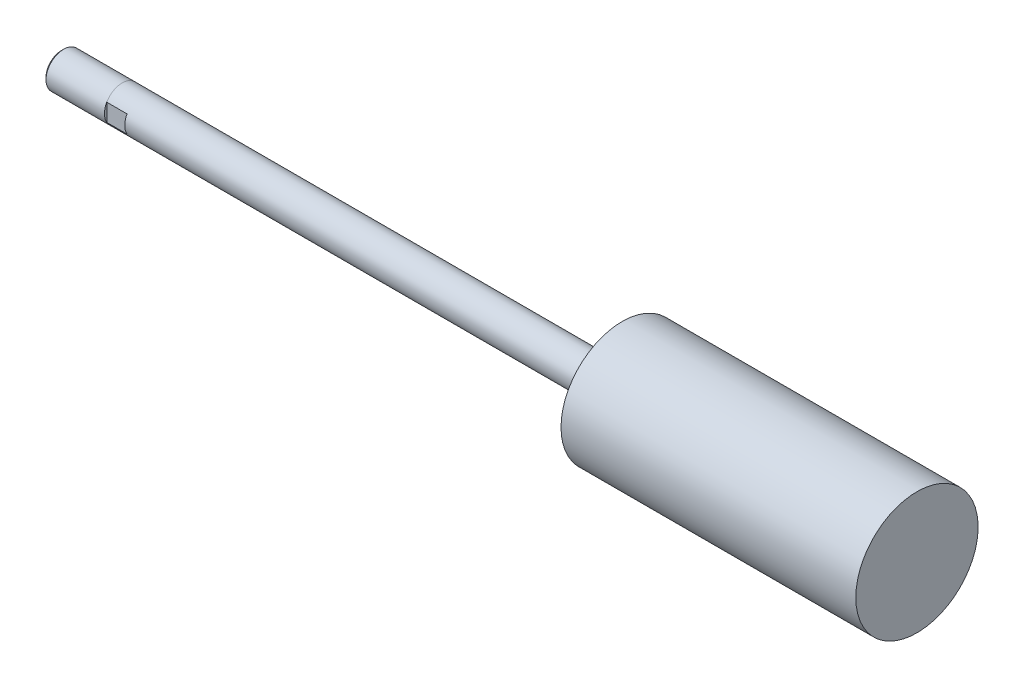
ISO-10303-21;
HEADER;
FILE_DESCRIPTION(('STEP AP214'),'2;1');
FILE_NAME('part.step','',(''),(''),'','','');
FILE_SCHEMA(('AUTOMOTIVE_DESIGN { 1 0 10303 214 1 1 1 1 }'));
ENDSEC;
DATA;
#1=APPLICATION_CONTEXT('core data for automotive mechanical design processes');
#2=APPLICATION_PROTOCOL_DEFINITION('international standard','automotive_design',2000,#1);
#3=PRODUCT_CONTEXT('',#1,'mechanical');
#4=PRODUCT('Part','Part','',(#3));
#5=PRODUCT_RELATED_PRODUCT_CATEGORY('part','',(#4));
#6=PRODUCT_DEFINITION_FORMATION('','',#4);
#7=PRODUCT_DEFINITION_CONTEXT('part definition',#1,'design');
#8=PRODUCT_DEFINITION('design','',#6,#7);
#9=PRODUCT_DEFINITION_SHAPE('','',#8);
#10=(LENGTH_UNIT() NAMED_UNIT(*) SI_UNIT(.MILLI.,.METRE.));
#11=(NAMED_UNIT(*) PLANE_ANGLE_UNIT() SI_UNIT($,.RADIAN.));
#12=(NAMED_UNIT(*) SI_UNIT($,.STERADIAN.) SOLID_ANGLE_UNIT());
#13=UNCERTAINTY_MEASURE_WITH_UNIT(LENGTH_MEASURE(1.E-05),#10,'distance_accuracy_value','');
#14=(GEOMETRIC_REPRESENTATION_CONTEXT(3) GLOBAL_UNCERTAINTY_ASSIGNED_CONTEXT((#13)) GLOBAL_UNIT_ASSIGNED_CONTEXT((#10,
#11,#12)) REPRESENTATION_CONTEXT('',''));
#15=CARTESIAN_POINT('',(0.,0.,0.));
#16=DIRECTION('',(0.,0.,1.));
#17=DIRECTION('',(1.,0.,0.));
#18=AXIS2_PLACEMENT_3D('',#15,#16,#17);
#19=CARTESIAN_POINT('',(242.443,0.,0.));
#20=DIRECTION('',(-1.,0.,0.));
#21=DIRECTION('',(0.,0.,1.));
#22=AXIS2_PLACEMENT_3D('',#19,#20,#21);
#23=CYLINDRICAL_SURFACE('',#22,5.5499);
#24=DIRECTION('',(-1.,0.,0.));
#25=VECTOR('',#24,1.);
#26=CARTESIAN_POINT('',(242.443,2.74064116768321,-4.826));
#27=LINE('',#26,#25);
#28=CARTESIAN_POINT('',(0.,2.74064116768321,-4.826));
#29=VERTEX_POINT('',#28);
#30=CARTESIAN_POINT('',(-6.35,2.74705930837324,-4.826));
#31=VERTEX_POINT('',#30);
#32=EDGE_CURVE('E100',#29,#31,#27,.T.);
#33=ORIENTED_EDGE('',*,*,#32,.T.);
#34=CARTESIAN_POINT('',(-6.35,0.,0.));
#35=DIRECTION('',(-1.,0.,0.));
#36=DIRECTION('',(0.,0.49469130573276,0.869068761394872));
#37=AXIS2_PLACEMENT_3D('',#34,#35,#36);
#38=CIRCLE('',#37,5.55625);
#39=CARTESIAN_POINT('',(-6.35,2.74705792258195,4.82600401218283));
#40=VERTEX_POINT('',#39);
#41=EDGE_CURVE('E80',#40,#31,#38,.T.);
#42=ORIENTED_EDGE('',*,*,#41,.F.);
#43=DIRECTION('',(-1.,0.,0.));
#44=VECTOR('',#43,1.);
#45=CARTESIAN_POINT('',(242.443,2.74064116768321,4.826));
#46=LINE('',#45,#44);
#47=CARTESIAN_POINT('',(0.,2.74064116768321,4.826));
#48=VERTEX_POINT('',#47);
#49=EDGE_CURVE('E109',#40,#48,#46,.F.);
#50=ORIENTED_EDGE('',*,*,#49,.T.);
#51=CARTESIAN_POINT('',(0.,0.,0.));
#52=DIRECTION('',(1.,0.,0.));
#53=DIRECTION('',(0.,0.,-1.));
#54=AXIS2_PLACEMENT_3D('',#51,#52,#53);
#55=CIRCLE('',#54,5.5499);
#56=CARTESIAN_POINT('',(0.,-2.74064116768321,4.826));
#57=VERTEX_POINT('',#56);
#58=EDGE_CURVE('E11',#48,#57,#55,.T.);
#59=ORIENTED_EDGE('',*,*,#58,.T.);
#60=DIRECTION('',(-1.,0.,0.));
#61=VECTOR('',#60,1.);
#62=CARTESIAN_POINT('',(242.443,-2.74064116768321,4.826));
#63=LINE('',#62,#61);
#64=CARTESIAN_POINT('',(-6.35,-2.74705930837324,4.826));
#65=VERTEX_POINT('',#64);
#66=EDGE_CURVE('E111',#57,#65,#63,.T.);
#67=ORIENTED_EDGE('',*,*,#66,.T.);
#68=CARTESIAN_POINT('',(-6.35,0.,0.));
#69=DIRECTION('',(-1.,0.,0.));
#70=DIRECTION('',(0.,-0.494691305732761,-0.869068761394871));
#71=AXIS2_PLACEMENT_3D('',#68,#69,#70);
#72=CIRCLE('',#71,5.55625);
#73=CARTESIAN_POINT('',(-6.35000000000001,-2.74705792258195,-4.82600401218282));
#74=VERTEX_POINT('',#73);
#75=EDGE_CURVE('E94',#74,#65,#72,.T.);
#76=ORIENTED_EDGE('',*,*,#75,.F.);
#77=DIRECTION('',(-1.,0.,0.));
#78=VECTOR('',#77,1.);
#79=CARTESIAN_POINT('',(242.443,-2.74064116768321,-4.826));
#80=LINE('',#79,#78);
#81=CARTESIAN_POINT('',(0.,-2.74064116768321,-4.826));
#82=VERTEX_POINT('',#81);
#83=EDGE_CURVE('E103',#74,#82,#80,.F.);
#84=ORIENTED_EDGE('',*,*,#83,.T.);
#85=EDGE_CURVE('E40',#82,#29,#55,.T.);
#86=ORIENTED_EDGE('',*,*,#85,.T.);
#87=EDGE_LOOP('',(#33,#42,#50,#59,#67,#76,#84,#86));
#88=FACE_BOUND('',#87,.T.);
#89=CARTESIAN_POINT('',(150.1648,0.,0.));
#90=DIRECTION('',(-1.,0.,0.));
#91=DIRECTION('',(0.,0.,1.));
#92=AXIS2_PLACEMENT_3D('',#89,#90,#91);
#93=CIRCLE('',#92,5.5499);
#94=CARTESIAN_POINT('',(150.1648,0.,5.5499));
#95=VERTEX_POINT('',#94);
#96=EDGE_CURVE('E199',#95,#95,#93,.T.);
#97=ORIENTED_EDGE('',*,*,#96,.T.);
#98=EDGE_LOOP('',(#97));
#99=FACE_BOUND('',#98,.T.);
#100=ADVANCED_FACE('F36',(#88,#99),#23,.T.);
#101=CARTESIAN_POINT('',(150.1648,5.5499,0.));
#102=DIRECTION('',(1.,0.,0.));
#103=DIRECTION('',(0.,0.,-1.));
#104=AXIS2_PLACEMENT_3D('',#101,#102,#103);
#105=PLANE('',#104);
#106=ORIENTED_EDGE('',*,*,#96,.F.);
#107=EDGE_LOOP('',(#106));
#108=FACE_BOUND('',#107,.T.);
#109=CARTESIAN_POINT('',(150.1648,0.,0.));
#110=DIRECTION('',(-1.,0.,0.));
#111=DIRECTION('',(0.,0.,1.));
#112=AXIS2_PLACEMENT_3D('',#109,#110,#111);
#113=CIRCLE('',#112,19.14525);
#114=CARTESIAN_POINT('',(150.1648,0.,19.14525));
#115=VERTEX_POINT('',#114);
#116=EDGE_CURVE('E201',#115,#115,#113,.T.);
#117=ORIENTED_EDGE('',*,*,#116,.T.);
#118=EDGE_LOOP('',(#117));
#119=FACE_BOUND('',#118,.T.);
#120=ADVANCED_FACE('F219',(#108,#119),#105,.F.);
#121=CARTESIAN_POINT('',(242.443,0.,0.));
#122=DIRECTION('',(-1.,0.,0.));
#123=DIRECTION('',(0.,0.,1.));
#124=AXIS2_PLACEMENT_3D('',#121,#122,#123);
#125=CYLINDRICAL_SURFACE('',#124,19.14525);
#126=ORIENTED_EDGE('',*,*,#116,.F.);
#127=EDGE_LOOP('',(#126));
#128=FACE_BOUND('',#127,.T.);
#129=CARTESIAN_POINT('',(242.443,0.,0.));
#130=DIRECTION('',(-1.,0.,0.));
#131=DIRECTION('',(0.,0.,1.));
#132=AXIS2_PLACEMENT_3D('',#129,#130,#131);
#133=CIRCLE('',#132,19.14525);
#134=CARTESIAN_POINT('',(242.443,0.,19.14525));
#135=VERTEX_POINT('',#134);
#136=EDGE_CURVE('E144',#135,#135,#133,.T.);
#137=ORIENTED_EDGE('',*,*,#136,.T.);
#138=EDGE_LOOP('',(#137));
#139=FACE_BOUND('',#138,.T.);
#140=ADVANCED_FACE('F208',(#128,#139),#125,.T.);
#141=CARTESIAN_POINT('',(242.443,19.14525,0.));
#142=DIRECTION('',(-1.,0.,0.));
#143=DIRECTION('',(0.,0.,1.));
#144=AXIS2_PLACEMENT_3D('',#141,#142,#143);
#145=PLANE('',#144);
#146=ORIENTED_EDGE('',*,*,#136,.F.);
#147=EDGE_LOOP('',(#146));
#148=FACE_BOUND('',#147,.T.);
#149=ADVANCED_FACE('F210',(#148),#145,.F.);
#150=CARTESIAN_POINT('',(-25.4,0.,0.));
#151=DIRECTION('',(1.,0.,0.));
#152=DIRECTION('',(0.,0.,-1.));
#153=AXIS2_PLACEMENT_3D('',#150,#151,#152);
#154=PLANE('',#153);
#155=CARTESIAN_POINT('',(-25.4,0.,0.));
#156=DIRECTION('',(-1.,0.,0.));
#157=DIRECTION('',(0.,0.,1.));
#158=AXIS2_PLACEMENT_3D('',#155,#156,#157);
#159=CIRCLE('',#158,4.8006);
#160=CARTESIAN_POINT('',(-25.4,0.,4.8006));
#161=VERTEX_POINT('',#160);
#162=EDGE_CURVE('E137',#161,#161,#159,.T.);
#163=ORIENTED_EDGE('',*,*,#162,.T.);
#164=EDGE_LOOP('',(#163));
#165=FACE_BOUND('',#164,.T.);
#166=ADVANCED_FACE('F212',(#165),#154,.F.);
#167=CARTESIAN_POINT('',(-24.64435,0.,0.));
#168=DIRECTION('',(1.,0.,0.));
#169=DIRECTION('',(0.,0.,-1.));
#170=AXIS2_PLACEMENT_3D('',#167,#168,#169);
#171=CONICAL_SURFACE('',#170,5.55625,0.785398163397451);
#172=ORIENTED_EDGE('',*,*,#162,.F.);
#173=EDGE_LOOP('',(#172));
#174=FACE_BOUND('',#173,.T.);
#175=CARTESIAN_POINT('',(-24.64435,0.,0.));
#176=DIRECTION('',(-1.,0.,0.));
#177=DIRECTION('',(0.,0.,1.));
#178=AXIS2_PLACEMENT_3D('',#175,#176,#177);
#179=CIRCLE('',#178,5.55625);
#180=CARTESIAN_POINT('',(-24.64435,0.,5.55625));
#181=VERTEX_POINT('',#180);
#182=EDGE_CURVE('E134',#181,#181,#179,.T.);
#183=ORIENTED_EDGE('',*,*,#182,.T.);
#184=EDGE_LOOP('',(#183));
#185=FACE_BOUND('',#184,.T.);
#186=ADVANCED_FACE('F172',(#174,#185),#171,.T.);
#187=CARTESIAN_POINT('',(-6.35,0.,0.));
#188=DIRECTION('',(-1.,0.,0.));
#189=DIRECTION('',(0.,0.,1.));
#190=AXIS2_PLACEMENT_3D('',#187,#188,#189);
#191=CYLINDRICAL_SURFACE('',#190,5.55625);
#192=ORIENTED_EDGE('',*,*,#182,.F.);
#193=EDGE_LOOP('',(#192));
#194=FACE_BOUND('',#193,.T.);
#195=ORIENTED_EDGE('',*,*,#41,.T.);
#196=CARTESIAN_POINT('',(-6.35,0.,0.));
#197=DIRECTION('',(-1.,0.,0.));
#198=DIRECTION('',(0.,0.494691305732778,-0.869068761394862));
#199=AXIS2_PLACEMENT_3D('',#196,#197,#198);
#200=CIRCLE('',#199,5.55625);
#201=EDGE_CURVE('E83',#31,#74,#200,.T.);
#202=ORIENTED_EDGE('',*,*,#201,.T.);
#203=ORIENTED_EDGE('',*,*,#75,.T.);
#204=CARTESIAN_POINT('',(-6.35,0.,0.));
#205=DIRECTION('',(-1.,0.,0.));
#206=DIRECTION('',(0.,-0.494691305732759,0.869068761394873));
#207=AXIS2_PLACEMENT_3D('',#204,#205,#206);
#208=CIRCLE('',#207,5.55625);
#209=EDGE_CURVE('E85',#65,#40,#208,.T.);
#210=ORIENTED_EDGE('',*,*,#209,.T.);
#211=EDGE_LOOP('',(#195,#202,#203,#210));
#212=FACE_BOUND('',#211,.T.);
#213=ADVANCED_FACE('F82',(#194,#212),#191,.T.);
#214=CARTESIAN_POINT('',(-6.35,0.,0.));
#215=DIRECTION('',(1.,0.,0.));
#216=DIRECTION('',(0.,0.,-1.));
#217=AXIS2_PLACEMENT_3D('',#214,#215,#216);
#218=PLANE('',#217);
#219=ORIENTED_EDGE('',*,*,#201,.F.);
#220=DIRECTION('',(0.,1.,0.));
#221=VECTOR('',#220,1.);
#222=CARTESIAN_POINT('',(-6.35,-5.5499,-4.826));
#223=LINE('',#222,#221);
#224=EDGE_CURVE('E50',#74,#31,#223,.T.);
#225=ORIENTED_EDGE('',*,*,#224,.F.);
#226=EDGE_LOOP('',(#219,#225));
#227=FACE_BOUND('',#226,.T.);
#228=ADVANCED_FACE('F93',(#227),#218,.T.);
#229=CARTESIAN_POINT('',(0.,-5.5499,-4.826));
#230=DIRECTION('',(0.,0.,1.));
#231=DIRECTION('',(1.,0.,0.));
#232=AXIS2_PLACEMENT_3D('',#229,#230,#231);
#233=PLANE('',#232);
#234=DIRECTION('',(0.,1.,0.));
#235=VECTOR('',#234,1.);
#236=CARTESIAN_POINT('',(0.,-5.5499,-4.826));
#237=LINE('',#236,#235);
#238=EDGE_CURVE('E113',#82,#29,#237,.T.);
#239=ORIENTED_EDGE('',*,*,#238,.F.);
#240=ORIENTED_EDGE('',*,*,#83,.F.);
#241=ORIENTED_EDGE('',*,*,#224,.T.);
#242=ORIENTED_EDGE('',*,*,#32,.F.);
#243=EDGE_LOOP('',(#239,#240,#241,#242));
#244=FACE_BOUND('',#243,.T.);
#245=ADVANCED_FACE('F99',(#244),#233,.F.);
#246=CARTESIAN_POINT('',(0.,0.,0.));
#247=DIRECTION('',(1.,0.,0.));
#248=DIRECTION('',(0.,0.,-1.));
#249=AXIS2_PLACEMENT_3D('',#246,#247,#248);
#250=PLANE('',#249);
#251=ORIENTED_EDGE('',*,*,#238,.T.);
#252=ORIENTED_EDGE('',*,*,#85,.F.);
#253=EDGE_LOOP('',(#251,#252));
#254=FACE_BOUND('',#253,.T.);
#255=ADVANCED_FACE('F260',(#254),#250,.F.);
#256=DIRECTION('',(0.,-1.,0.));
#257=VECTOR('',#256,1.);
#258=CARTESIAN_POINT('',(0.,5.5499,4.826));
#259=LINE('',#258,#257);
#260=EDGE_CURVE('E105',#48,#57,#259,.T.);
#261=ORIENTED_EDGE('',*,*,#260,.T.);
#262=ORIENTED_EDGE('',*,*,#58,.F.);
#263=EDGE_LOOP('',(#261,#262));
#264=FACE_BOUND('',#263,.T.);
#265=ADVANCED_FACE('F130',(#264),#250,.F.);
#266=ORIENTED_EDGE('',*,*,#209,.F.);
#267=DIRECTION('',(0.,-1.,0.));
#268=VECTOR('',#267,1.);
#269=CARTESIAN_POINT('',(-6.35,5.5499,4.826));
#270=LINE('',#269,#268);
#271=EDGE_CURVE('E57',#40,#65,#270,.T.);
#272=ORIENTED_EDGE('',*,*,#271,.F.);
#273=EDGE_LOOP('',(#266,#272));
#274=FACE_BOUND('',#273,.T.);
#275=ADVANCED_FACE('F150',(#274),#218,.T.);
#276=CARTESIAN_POINT('',(0.,5.5499,4.826));
#277=DIRECTION('',(0.,0.,-1.));
#278=DIRECTION('',(-1.,0.,0.));
#279=AXIS2_PLACEMENT_3D('',#276,#277,#278);
#280=PLANE('',#279);
#281=ORIENTED_EDGE('',*,*,#260,.F.);
#282=ORIENTED_EDGE('',*,*,#49,.F.);
#283=ORIENTED_EDGE('',*,*,#271,.T.);
#284=ORIENTED_EDGE('',*,*,#66,.F.);
#285=EDGE_LOOP('',(#281,#282,#283,#284));
#286=FACE_BOUND('',#285,.T.);
#287=ADVANCED_FACE('F133',(#286),#280,.F.);
#288=CLOSED_SHELL('',(#100,#120,#140,#149,#166,#186,#213,#228,#245,#255,#265,#275,#287));
#289=MANIFOLD_SOLID_BREP('B2',#288);
#290=ADVANCED_BREP_SHAPE_REPRESENTATION('',(#18,#289),#14);
#291=SHAPE_DEFINITION_REPRESENTATION(#9,#290);
ENDSEC;
END-ISO-10303-21;
